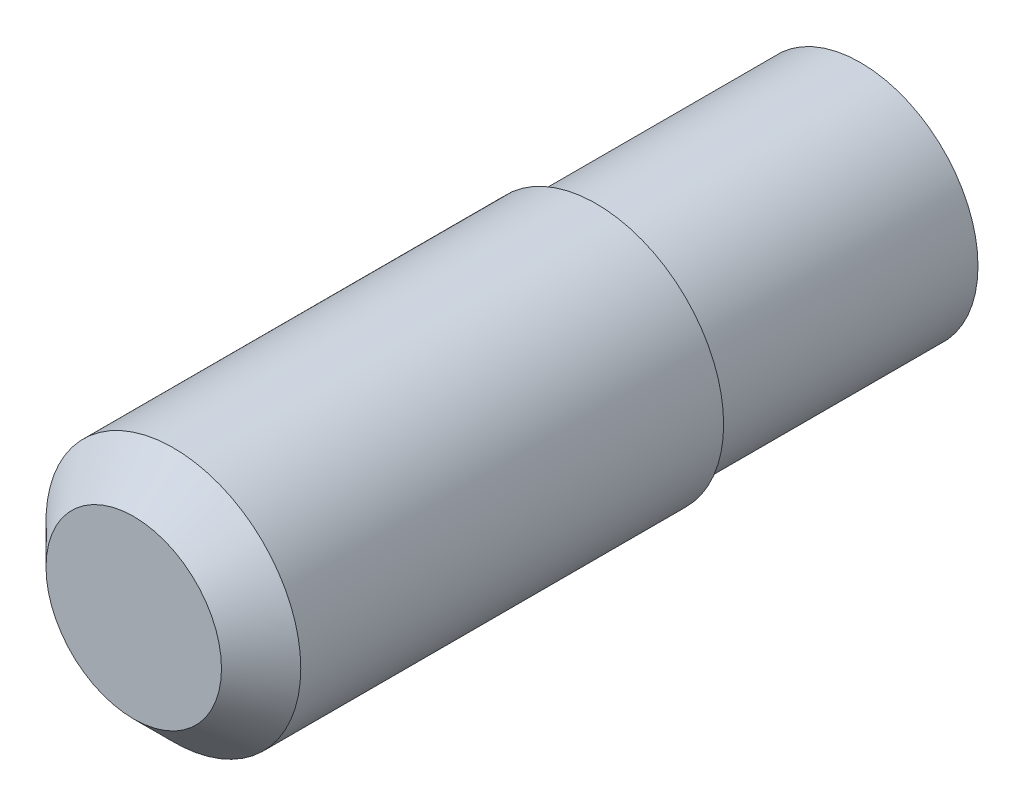
ISO-10303-21;
HEADER;
FILE_DESCRIPTION(('STEP AP214'),'2;1');
FILE_NAME('part.step','',(''),(''),'','','');
FILE_SCHEMA(('AUTOMOTIVE_DESIGN { 1 0 10303 214 1 1 1 1 }'));
ENDSEC;
DATA;
#1=APPLICATION_CONTEXT('core data for automotive mechanical design processes');
#2=APPLICATION_PROTOCOL_DEFINITION('international standard','automotive_design',2000,#1);
#3=PRODUCT_CONTEXT('',#1,'mechanical');
#4=PRODUCT('Part','Part','',(#3));
#5=PRODUCT_RELATED_PRODUCT_CATEGORY('part','',(#4));
#6=PRODUCT_DEFINITION_FORMATION('','',#4);
#7=PRODUCT_DEFINITION_CONTEXT('part definition',#1,'design');
#8=PRODUCT_DEFINITION('design','',#6,#7);
#9=PRODUCT_DEFINITION_SHAPE('','',#8);
#10=(LENGTH_UNIT() NAMED_UNIT(*) SI_UNIT(.MILLI.,.METRE.));
#11=(NAMED_UNIT(*) PLANE_ANGLE_UNIT() SI_UNIT($,.RADIAN.));
#12=(NAMED_UNIT(*) SI_UNIT($,.STERADIAN.) SOLID_ANGLE_UNIT());
#13=UNCERTAINTY_MEASURE_WITH_UNIT(LENGTH_MEASURE(1.E-05),#10,'distance_accuracy_value','');
#14=(GEOMETRIC_REPRESENTATION_CONTEXT(3) GLOBAL_UNCERTAINTY_ASSIGNED_CONTEXT((#13)) GLOBAL_UNIT_ASSIGNED_CONTEXT((#10,
#11,#12)) REPRESENTATION_CONTEXT('',''));
#15=CARTESIAN_POINT('',(0.,0.,0.));
#16=DIRECTION('',(0.,0.,1.));
#17=DIRECTION('',(1.,0.,0.));
#18=AXIS2_PLACEMENT_3D('',#15,#16,#17);
#19=CARTESIAN_POINT('',(137.157808661758,37.1712921928097,13.3333333333333));
#20=DIRECTION('',(0.,0.,-1.));
#21=DIRECTION('',(-1.,0.,0.));
#22=AXIS2_PLACEMENT_3D('',#19,#20,#21);
#23=CYLINDRICAL_SURFACE('',#22,5.92666666666665);
#24=CARTESIAN_POINT('',(137.157808661758,37.1712921928097,13.3333333333333));
#25=DIRECTION('',(0.,0.,1.));
#26=DIRECTION('',(1.,0.,0.));
#27=AXIS2_PLACEMENT_3D('',#24,#25,#26);
#28=CIRCLE('',#27,5.92666666666665);
#29=CARTESIAN_POINT('',(143.084475328424,37.1712921928097,13.3333333333333));
#30=VERTEX_POINT('',#29);
#31=EDGE_CURVE('E41',#30,#30,#28,.T.);
#32=ORIENTED_EDGE('',*,*,#31,.F.);
#33=EDGE_LOOP('',(#32));
#34=FACE_BOUND('',#33,.T.);
#35=CARTESIAN_POINT('',(137.157808661758,37.1712921928097,0.));
#36=DIRECTION('',(0.,0.,1.));
#37=DIRECTION('',(1.,0.,0.));
#38=AXIS2_PLACEMENT_3D('',#35,#36,#37);
#39=CIRCLE('',#38,5.92666666666665);
#40=CARTESIAN_POINT('',(143.084475328424,37.1712921928097,0.));
#41=VERTEX_POINT('',#40);
#42=EDGE_CURVE('E45',#41,#41,#39,.T.);
#43=ORIENTED_EDGE('',*,*,#42,.T.);
#44=EDGE_LOOP('',(#43));
#45=FACE_BOUND('',#44,.T.);
#46=ADVANCED_FACE('F30',(#34,#45),#23,.T.);
#47=CARTESIAN_POINT('',(137.157808661758,37.1712921928097,0.));
#48=DIRECTION('',(0.,0.,1.));
#49=DIRECTION('',(1.,0.,0.));
#50=AXIS2_PLACEMENT_3D('',#47,#48,#49);
#51=PLANE('',#50);
#52=ORIENTED_EDGE('',*,*,#42,.F.);
#53=EDGE_LOOP('',(#52));
#54=FACE_BOUND('',#53,.T.);
#55=ADVANCED_FACE('F66',(#54),#51,.F.);
#56=CARTESIAN_POINT('',(137.157808661758,37.1712921928097,30.));
#57=DIRECTION('',(0.,0.,-1.));
#58=DIRECTION('',(-1.,0.,0.));
#59=AXIS2_PLACEMENT_3D('',#56,#57,#58);
#60=CYLINDRICAL_SURFACE('',#59,6.42666666666668);
#61=CARTESIAN_POINT('',(137.157808661758,37.1712921928097,34.6666666666666));
#62=DIRECTION('',(0.,0.,1.));
#63=DIRECTION('',(1.,0.,0.));
#64=AXIS2_PLACEMENT_3D('',#61,#62,#63);
#65=CIRCLE('',#64,6.42666666666668);
#66=CARTESIAN_POINT('',(143.584475328424,37.1712921928097,34.6666666666666));
#67=VERTEX_POINT('',#66);
#68=EDGE_CURVE('E10',#67,#67,#65,.F.);
#69=ORIENTED_EDGE('',*,*,#68,.T.);
#70=EDGE_LOOP('',(#69));
#71=FACE_BOUND('',#70,.T.);
#72=CARTESIAN_POINT('',(137.157808661758,37.1712921928097,13.3333333333333));
#73=DIRECTION('',(0.,0.,1.));
#74=DIRECTION('',(1.,0.,0.));
#75=AXIS2_PLACEMENT_3D('',#72,#73,#74);
#76=CIRCLE('',#75,6.42666666666668);
#77=CARTESIAN_POINT('',(143.584475328424,37.1712921928097,13.3333333333333));
#78=VERTEX_POINT('',#77);
#79=EDGE_CURVE('E49',#78,#78,#76,.T.);
#80=ORIENTED_EDGE('',*,*,#79,.T.);
#81=EDGE_LOOP('',(#80));
#82=FACE_BOUND('',#81,.T.);
#83=ADVANCED_FACE('F54',(#71,#82),#60,.T.);
#84=CARTESIAN_POINT('',(137.157808661758,37.1712921928097,13.3333333333333));
#85=DIRECTION('',(0.,0.,1.));
#86=DIRECTION('',(1.,0.,0.));
#87=AXIS2_PLACEMENT_3D('',#84,#85,#86);
#88=PLANE('',#87);
#89=ORIENTED_EDGE('',*,*,#31,.T.);
#90=EDGE_LOOP('',(#89));
#91=FACE_BOUND('',#90,.T.);
#92=ORIENTED_EDGE('',*,*,#79,.F.);
#93=EDGE_LOOP('',(#92));
#94=FACE_BOUND('',#93,.T.);
#95=ADVANCED_FACE('F56',(#91,#94),#88,.F.);
#96=CARTESIAN_POINT('',(137.157808661758,37.1712921928097,36.6666666666667));
#97=DIRECTION('',(0.,0.,1.));
#98=DIRECTION('',(1.,0.,0.));
#99=AXIS2_PLACEMENT_3D('',#96,#97,#98);
#100=PLANE('',#99);
#101=CARTESIAN_POINT('',(137.157808661758,37.1712921928097,36.6666666666667));
#102=DIRECTION('',(0.,0.,1.));
#103=DIRECTION('',(1.,0.,0.));
#104=AXIS2_PLACEMENT_3D('',#101,#102,#103);
#105=CIRCLE('',#104,4.42666666666663);
#106=CARTESIAN_POINT('',(141.584475328424,37.1712921928097,36.6666666666667));
#107=VERTEX_POINT('',#106);
#108=EDGE_CURVE('E37',#107,#107,#105,.T.);
#109=ORIENTED_EDGE('',*,*,#108,.T.);
#110=EDGE_LOOP('',(#109));
#111=FACE_BOUND('',#110,.T.);
#112=ADVANCED_FACE('F58',(#111),#100,.T.);
#113=CARTESIAN_POINT('',(137.157808661758,37.1712921928097,36.6666666666667));
#114=DIRECTION('',(0.,0.,-1.));
#115=DIRECTION('',(-1.,0.,0.));
#116=AXIS2_PLACEMENT_3D('',#113,#114,#115);
#117=CONICAL_SURFACE('',#116,4.42666666666663,0.785398163397452);
#118=ORIENTED_EDGE('',*,*,#68,.F.);
#119=EDGE_LOOP('',(#118));
#120=FACE_BOUND('',#119,.T.);
#121=ORIENTED_EDGE('',*,*,#108,.F.);
#122=EDGE_LOOP('',(#121));
#123=FACE_BOUND('',#122,.T.);
#124=ADVANCED_FACE('F32',(#120,#123),#117,.T.);
#125=CLOSED_SHELL('',(#46,#55,#83,#95,#112,#124));
#126=MANIFOLD_SOLID_BREP('B2',#125);
#127=ADVANCED_BREP_SHAPE_REPRESENTATION('',(#18,#126),#14);
#128=SHAPE_DEFINITION_REPRESENTATION(#9,#127);
ENDSEC;
END-ISO-10303-21;
